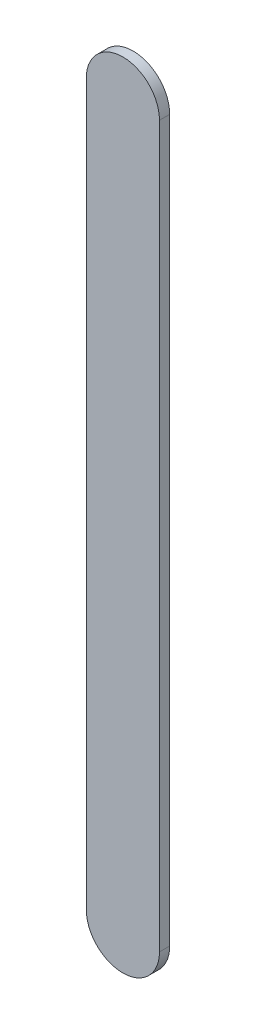
ISO-10303-21;
HEADER;
FILE_DESCRIPTION(('STEP AP214'),'2;1');
FILE_NAME('part.step','',(''),(''),'','','');
FILE_SCHEMA(('AUTOMOTIVE_DESIGN { 1 0 10303 214 1 1 1 1 }'));
ENDSEC;
DATA;
#1=APPLICATION_CONTEXT('core data for automotive mechanical design processes');
#2=APPLICATION_PROTOCOL_DEFINITION('international standard','automotive_design',2000,#1);
#3=PRODUCT_CONTEXT('',#1,'mechanical');
#4=PRODUCT('Part','Part','',(#3));
#5=PRODUCT_RELATED_PRODUCT_CATEGORY('part','',(#4));
#6=PRODUCT_DEFINITION_FORMATION('','',#4);
#7=PRODUCT_DEFINITION_CONTEXT('part definition',#1,'design');
#8=PRODUCT_DEFINITION('design','',#6,#7);
#9=PRODUCT_DEFINITION_SHAPE('','',#8);
#10=(LENGTH_UNIT() NAMED_UNIT(*) SI_UNIT(.MILLI.,.METRE.));
#11=(NAMED_UNIT(*) PLANE_ANGLE_UNIT() SI_UNIT($,.RADIAN.));
#12=(NAMED_UNIT(*) SI_UNIT($,.STERADIAN.) SOLID_ANGLE_UNIT());
#13=UNCERTAINTY_MEASURE_WITH_UNIT(LENGTH_MEASURE(1.E-05),#10,'distance_accuracy_value','');
#14=(GEOMETRIC_REPRESENTATION_CONTEXT(3) GLOBAL_UNCERTAINTY_ASSIGNED_CONTEXT((#13)) GLOBAL_UNIT_ASSIGNED_CONTEXT((#10,
#11,#12)) REPRESENTATION_CONTEXT('',''));
#15=CARTESIAN_POINT('',(0.,0.,0.));
#16=DIRECTION('',(0.,0.,1.));
#17=DIRECTION('',(1.,0.,0.));
#18=AXIS2_PLACEMENT_3D('',#15,#16,#17);
#19=CARTESIAN_POINT('',(95.6339464,90.1869672,0.));
#20=DIRECTION('',(-1.,0.,0.));
#21=DIRECTION('',(0.,1.,0.));
#22=AXIS2_PLACEMENT_3D('',#19,#20,#21);
#23=PLANE('',#22);
#24=DIRECTION('',(0.,1.,0.));
#25=VECTOR('',#24,1.);
#26=CARTESIAN_POINT('',(95.6339464,90.1869672,0.03556));
#27=LINE('',#26,#25);
#28=CARTESIAN_POINT('',(95.6339464,90.1869672,0.03556));
#29=VERTEX_POINT('',#28);
#30=CARTESIAN_POINT('',(95.6339464,92.6869368,0.03556));
#31=VERTEX_POINT('',#30);
#32=EDGE_CURVE('E11',#29,#31,#27,.T.);
#33=ORIENTED_EDGE('',*,*,#32,.F.);
#34=DIRECTION('',(0.,0.,1.));
#35=VECTOR('',#34,1.);
#36=CARTESIAN_POINT('',(95.6339464,90.1869672,0.));
#37=LINE('',#36,#35);
#38=CARTESIAN_POINT('',(95.6339464,90.1869672,0.));
#39=VERTEX_POINT('',#38);
#40=EDGE_CURVE('E24',#39,#29,#37,.T.);
#41=ORIENTED_EDGE('',*,*,#40,.F.);
#42=DIRECTION('',(0.,1.,0.));
#43=VECTOR('',#42,1.);
#44=CARTESIAN_POINT('',(95.6339464,90.1869672,0.));
#45=LINE('',#44,#43);
#46=CARTESIAN_POINT('',(95.6339464,92.6869368,0.));
#47=VERTEX_POINT('',#46);
#48=EDGE_CURVE('E75',#39,#47,#45,.T.);
#49=ORIENTED_EDGE('',*,*,#48,.T.);
#50=DIRECTION('',(0.,0.,1.));
#51=VECTOR('',#50,1.);
#52=CARTESIAN_POINT('',(95.6339464,92.6869368,0.));
#53=LINE('',#52,#51);
#54=EDGE_CURVE('E37',#47,#31,#53,.T.);
#55=ORIENTED_EDGE('',*,*,#54,.T.);
#56=EDGE_LOOP('',(#33,#41,#49,#55));
#57=FACE_BOUND('',#56,.T.);
#58=ADVANCED_FACE('F17',(#57),#23,.F.);
#59=CARTESIAN_POINT('',(95.5069464,92.6869368,0.));
#60=DIRECTION('',(0.,0.,-1.));
#61=DIRECTION('',(1.,-1.11896493820492E-13,0.));
#62=AXIS2_PLACEMENT_3D('',#59,#60,#61);
#63=CYLINDRICAL_SURFACE('',#62,0.126999999999995);
#64=CARTESIAN_POINT('',(95.5069464,92.6869368,0.03556));
#65=DIRECTION('',(0.,0.,1.));
#66=DIRECTION('',(1.,-1.11896493820492E-13,0.));
#67=AXIS2_PLACEMENT_3D('',#64,#65,#66);
#68=CIRCLE('',#67,0.126999999999995);
#69=CARTESIAN_POINT('',(95.3799464,92.6869368,0.03556));
#70=VERTEX_POINT('',#69);
#71=EDGE_CURVE('E83',#31,#70,#68,.T.);
#72=ORIENTED_EDGE('',*,*,#71,.F.);
#73=ORIENTED_EDGE('',*,*,#54,.F.);
#74=CARTESIAN_POINT('',(95.5069464,92.6869368,0.));
#75=DIRECTION('',(0.,0.,1.));
#76=DIRECTION('',(1.,-1.11896493820492E-13,0.));
#77=AXIS2_PLACEMENT_3D('',#74,#75,#76);
#78=CIRCLE('',#77,0.126999999999995);
#79=CARTESIAN_POINT('',(95.3799464,92.6869368,0.));
#80=VERTEX_POINT('',#79);
#81=EDGE_CURVE('E81',#47,#80,#78,.T.);
#82=ORIENTED_EDGE('',*,*,#81,.T.);
#83=DIRECTION('',(0.,0.,1.));
#84=VECTOR('',#83,1.);
#85=CARTESIAN_POINT('',(95.3799464,92.6869368,0.));
#86=LINE('',#85,#84);
#87=EDGE_CURVE('E67',#80,#70,#86,.T.);
#88=ORIENTED_EDGE('',*,*,#87,.T.);
#89=EDGE_LOOP('',(#72,#73,#82,#88));
#90=FACE_BOUND('',#89,.T.);
#91=ADVANCED_FACE('F89',(#90),#63,.T.);
#92=CARTESIAN_POINT('',(95.3799464,92.6869368,0.));
#93=DIRECTION('',(1.,0.,0.));
#94=DIRECTION('',(0.,-1.,0.));
#95=AXIS2_PLACEMENT_3D('',#92,#93,#94);
#96=PLANE('',#95);
#97=DIRECTION('',(0.,-1.,0.));
#98=VECTOR('',#97,1.);
#99=CARTESIAN_POINT('',(95.3799464,92.6869368,0.03556));
#100=LINE('',#99,#98);
#101=CARTESIAN_POINT('',(95.3799464,90.1869672,0.03556));
#102=VERTEX_POINT('',#101);
#103=EDGE_CURVE('E71',#70,#102,#100,.T.);
#104=ORIENTED_EDGE('',*,*,#103,.F.);
#105=ORIENTED_EDGE('',*,*,#87,.F.);
#106=DIRECTION('',(0.,-1.,0.));
#107=VECTOR('',#106,1.);
#108=CARTESIAN_POINT('',(95.3799464,92.6869368,0.));
#109=LINE('',#108,#107);
#110=CARTESIAN_POINT('',(95.3799464,90.1869672,0.));
#111=VERTEX_POINT('',#110);
#112=EDGE_CURVE('E63',#80,#111,#109,.T.);
#113=ORIENTED_EDGE('',*,*,#112,.T.);
#114=DIRECTION('',(0.,0.,1.));
#115=VECTOR('',#114,1.);
#116=CARTESIAN_POINT('',(95.3799464,90.1869672,0.));
#117=LINE('',#116,#115);
#118=EDGE_CURVE('E53',#111,#102,#117,.T.);
#119=ORIENTED_EDGE('',*,*,#118,.T.);
#120=EDGE_LOOP('',(#104,#105,#113,#119));
#121=FACE_BOUND('',#120,.T.);
#122=ADVANCED_FACE('F66',(#121),#96,.F.);
#123=CARTESIAN_POINT('',(95.5069464,90.1869672,0.));
#124=DIRECTION('',(0.,0.,-1.));
#125=DIRECTION('',(-1.,1.11896493820492E-13,0.));
#126=AXIS2_PLACEMENT_3D('',#123,#124,#125);
#127=CYLINDRICAL_SURFACE('',#126,0.126999999999991);
#128=CARTESIAN_POINT('',(95.5069464,90.1869672,0.03556));
#129=DIRECTION('',(0.,0.,1.));
#130=DIRECTION('',(-1.,1.11896493820492E-13,0.));
#131=AXIS2_PLACEMENT_3D('',#128,#129,#130);
#132=CIRCLE('',#131,0.126999999999991);
#133=EDGE_CURVE('E59',#102,#29,#132,.T.);
#134=ORIENTED_EDGE('',*,*,#133,.F.);
#135=ORIENTED_EDGE('',*,*,#118,.F.);
#136=CARTESIAN_POINT('',(95.5069464,90.1869672,0.));
#137=DIRECTION('',(0.,0.,1.));
#138=DIRECTION('',(-1.,1.11896493820492E-13,0.));
#139=AXIS2_PLACEMENT_3D('',#136,#137,#138);
#140=CIRCLE('',#139,0.126999999999991);
#141=EDGE_CURVE('E57',#111,#39,#140,.T.);
#142=ORIENTED_EDGE('',*,*,#141,.T.);
#143=ORIENTED_EDGE('',*,*,#40,.T.);
#144=EDGE_LOOP('',(#134,#135,#142,#143));
#145=FACE_BOUND('',#144,.T.);
#146=ADVANCED_FACE('F55',(#145),#127,.T.);
#147=CARTESIAN_POINT('',(95.6339464,90.1869672,0.));
#148=DIRECTION('',(0.,0.,-1.));
#149=DIRECTION('',(-1.,0.,0.));
#150=AXIS2_PLACEMENT_3D('',#147,#148,#149);
#151=PLANE('',#150);
#152=ORIENTED_EDGE('',*,*,#141,.F.);
#153=ORIENTED_EDGE('',*,*,#112,.F.);
#154=ORIENTED_EDGE('',*,*,#81,.F.);
#155=ORIENTED_EDGE('',*,*,#48,.F.);
#156=EDGE_LOOP('',(#152,#153,#154,#155));
#157=FACE_BOUND('',#156,.T.);
#158=ADVANCED_FACE('F74',(#157),#151,.T.);
#159=CARTESIAN_POINT('',(95.6339464,90.1869672,0.03556));
#160=DIRECTION('',(0.,0.,-1.));
#161=DIRECTION('',(-1.,0.,0.));
#162=AXIS2_PLACEMENT_3D('',#159,#160,#161);
#163=PLANE('',#162);
#164=ORIENTED_EDGE('',*,*,#32,.T.);
#165=ORIENTED_EDGE('',*,*,#71,.T.);
#166=ORIENTED_EDGE('',*,*,#103,.T.);
#167=ORIENTED_EDGE('',*,*,#133,.T.);
#168=EDGE_LOOP('',(#164,#165,#166,#167));
#169=FACE_BOUND('',#168,.T.);
#170=ADVANCED_FACE('F91',(#169),#163,.F.);
#171=CLOSED_SHELL('',(#58,#91,#122,#146,#158,#170));
#172=MANIFOLD_SOLID_BREP('B1',#171);
#173=ADVANCED_BREP_SHAPE_REPRESENTATION('',(#18,#172),#14);
#174=SHAPE_DEFINITION_REPRESENTATION(#9,#173);
ENDSEC;
END-ISO-10303-21;
